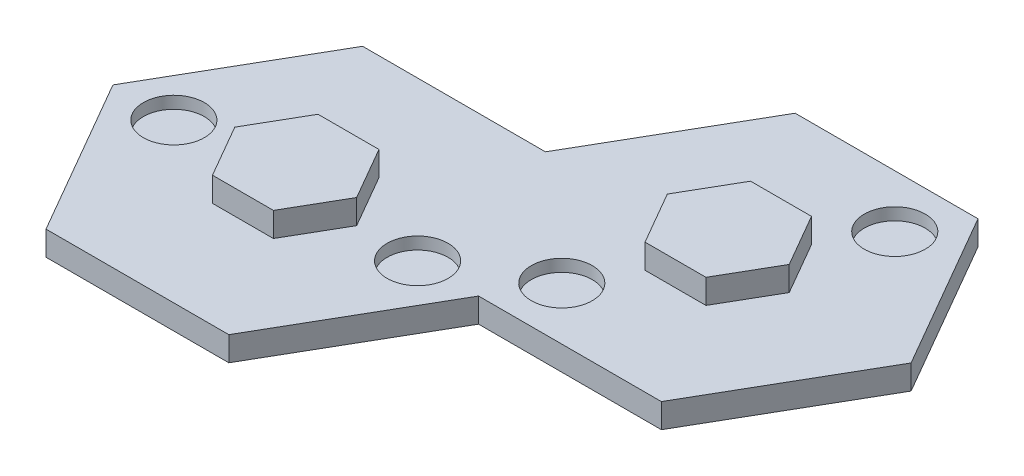
ISO-10303-21;
HEADER;
FILE_DESCRIPTION(('STEP AP214'),'2;1');
FILE_NAME('part.step','',(''),(''),'','','');
FILE_SCHEMA(('AUTOMOTIVE_DESIGN { 1 0 10303 214 1 1 1 1 }'));
ENDSEC;
DATA;
#1=APPLICATION_CONTEXT('core data for automotive mechanical design processes');
#2=APPLICATION_PROTOCOL_DEFINITION('international standard','automotive_design',2000,#1);
#3=PRODUCT_CONTEXT('',#1,'mechanical');
#4=PRODUCT('Part','Part','',(#3));
#5=PRODUCT_RELATED_PRODUCT_CATEGORY('part','',(#4));
#6=PRODUCT_DEFINITION_FORMATION('','',#4);
#7=PRODUCT_DEFINITION_CONTEXT('part definition',#1,'design');
#8=PRODUCT_DEFINITION('design','',#6,#7);
#9=PRODUCT_DEFINITION_SHAPE('','',#8);
#10=(LENGTH_UNIT() NAMED_UNIT(*) SI_UNIT(.MILLI.,.METRE.));
#11=(NAMED_UNIT(*) PLANE_ANGLE_UNIT() SI_UNIT($,.RADIAN.));
#12=(NAMED_UNIT(*) SI_UNIT($,.STERADIAN.) SOLID_ANGLE_UNIT());
#13=UNCERTAINTY_MEASURE_WITH_UNIT(LENGTH_MEASURE(1.E-05),#10,'distance_accuracy_value','');
#14=(GEOMETRIC_REPRESENTATION_CONTEXT(3) GLOBAL_UNCERTAINTY_ASSIGNED_CONTEXT((#13)) GLOBAL_UNIT_ASSIGNED_CONTEXT((#10,
#11,#12)) REPRESENTATION_CONTEXT('',''));
#15=CARTESIAN_POINT('',(0.,0.,0.));
#16=DIRECTION('',(0.,0.,1.));
#17=DIRECTION('',(1.,0.,0.));
#18=AXIS2_PLACEMENT_3D('',#15,#16,#17);
#19=CARTESIAN_POINT('',(0.,10.16,0.));
#20=DIRECTION('',(0.,1.,0.));
#21=DIRECTION('',(0.,0.,1.));
#22=AXIS2_PLACEMENT_3D('',#19,#20,#21);
#23=PLANE('',#22);
#24=DIRECTION('',(-0.5,0.,-0.866025403784439));
#25=VECTOR('',#24,1.);
#26=CARTESIAN_POINT('',(101.6,10.1599999999997,-43.9940905122495));
#27=LINE('',#26,#25);
#28=CARTESIAN_POINT('',(101.6,10.16,-43.9940905122496));
#29=VERTEX_POINT('',#28);
#30=CARTESIAN_POINT('',(88.9000000000001,10.1599999999997,-65.9911357683743));
#31=VERTEX_POINT('',#30);
#32=EDGE_CURVE('E187',#29,#31,#27,.T.);
#33=ORIENTED_EDGE('',*,*,#32,.T.);
#34=DIRECTION('',(0.5,0.,-0.866025403784439));
#35=VECTOR('',#34,1.);
#36=CARTESIAN_POINT('',(88.9000000000001,10.1599999999997,-65.9911357683743));
#37=LINE('',#36,#35);
#38=CARTESIAN_POINT('',(101.6,10.16,-87.9881810244991));
#39=VERTEX_POINT('',#38);
#40=EDGE_CURVE('E202',#31,#39,#37,.T.);
#41=ORIENTED_EDGE('',*,*,#40,.T.);
#42=DIRECTION('',(1.,0.,0.));
#43=VECTOR('',#42,1.);
#44=CARTESIAN_POINT('',(101.6,10.1599999999996,-87.988181024499));
#45=LINE('',#44,#43);
#46=CARTESIAN_POINT('',(127.,10.16,-87.988181024499));
#47=VERTEX_POINT('',#46);
#48=EDGE_CURVE('E222',#39,#47,#45,.T.);
#49=ORIENTED_EDGE('',*,*,#48,.T.);
#50=DIRECTION('',(0.5,0.,0.866025403784439));
#51=VECTOR('',#50,1.);
#52=CARTESIAN_POINT('',(127.,10.1599999999994,-87.988181024499));
#53=LINE('',#52,#51);
#54=CARTESIAN_POINT('',(139.7,10.16,-65.9911357683743));
#55=VERTEX_POINT('',#54);
#56=EDGE_CURVE('E220',#47,#55,#53,.T.);
#57=ORIENTED_EDGE('',*,*,#56,.T.);
#58=DIRECTION('',(-0.5,0.,0.866025403784439));
#59=VECTOR('',#58,1.);
#60=CARTESIAN_POINT('',(139.7,10.1599999999994,-65.9911357683743));
#61=LINE('',#60,#59);
#62=CARTESIAN_POINT('',(127.,10.16,-43.9940905122496));
#63=VERTEX_POINT('',#62);
#64=EDGE_CURVE('E53',#55,#63,#61,.T.);
#65=ORIENTED_EDGE('',*,*,#64,.T.);
#66=DIRECTION('',(-1.,0.,0.));
#67=VECTOR('',#66,1.);
#68=CARTESIAN_POINT('',(127.,10.1599999999996,-43.9940905122496));
#69=LINE('',#68,#67);
#70=EDGE_CURVE('E48',#63,#29,#69,.T.);
#71=ORIENTED_EDGE('',*,*,#70,.T.);
#72=EDGE_LOOP('',(#33,#41,#49,#57,#65,#71));
#73=FACE_BOUND('',#72,.T.);
#74=CARTESIAN_POINT('',(88.9,10.16,-21.9970452561247));
#75=DIRECTION('',(0.,-1.,0.));
#76=DIRECTION('',(-0.866025403784439,0.,-0.5));
#77=AXIS2_PLACEMENT_3D('',#74,#75,#76);
#78=CIRCLE('',#77,12.7);
#79=CARTESIAN_POINT('',(77.9014773719376,10.16,-28.3470452561247));
#80=VERTEX_POINT('',#79);
#81=EDGE_CURVE('E283',#80,#80,#78,.T.);
#82=ORIENTED_EDGE('',*,*,#81,.T.);
#83=EDGE_LOOP('',(#82));
#84=FACE_BOUND('',#83,.T.);
#85=CARTESIAN_POINT('',(139.7,10.16,-109.985226280624));
#86=DIRECTION('',(0.,-1.,0.));
#87=DIRECTION('',(0.866025403784439,0.,0.5));
#88=AXIS2_PLACEMENT_3D('',#85,#86,#87);
#89=CIRCLE('',#88,12.7);
#90=CARTESIAN_POINT('',(150.698522628062,10.16,-103.635226280624));
#91=VERTEX_POINT('',#90);
#92=EDGE_CURVE('E278',#91,#91,#89,.T.);
#93=ORIENTED_EDGE('',*,*,#92,.T.);
#94=EDGE_LOOP('',(#93));
#95=FACE_BOUND('',#94,.T.);
#96=CARTESIAN_POINT('',(50.8,10.16,0.));
#97=DIRECTION('',(0.,1.,0.));
#98=DIRECTION('',(0.,0.,-1.));
#99=AXIS2_PLACEMENT_3D('',#96,#97,#98);
#100=CIRCLE('',#99,12.7);
#101=CARTESIAN_POINT('',(50.8,10.16,-12.7));
#102=VERTEX_POINT('',#101);
#103=EDGE_CURVE('E333',#102,#102,#100,.T.);
#104=ORIENTED_EDGE('',*,*,#103,.F.);
#105=EDGE_LOOP('',(#104));
#106=FACE_BOUND('',#105,.T.);
#107=CARTESIAN_POINT('',(-50.8,10.16,0.));
#108=DIRECTION('',(0.,1.,0.));
#109=DIRECTION('',(0.,0.,1.));
#110=AXIS2_PLACEMENT_3D('',#107,#108,#109);
#111=CIRCLE('',#110,12.7);
#112=CARTESIAN_POINT('',(-50.8,10.16,12.7));
#113=VERTEX_POINT('',#112);
#114=EDGE_CURVE('E328',#113,#113,#111,.T.);
#115=ORIENTED_EDGE('',*,*,#114,.F.);
#116=EDGE_LOOP('',(#115));
#117=FACE_BOUND('',#116,.T.);
#118=DIRECTION('',(0.5,0.,-0.866025403784438));
#119=VECTOR('',#118,1.);
#120=CARTESIAN_POINT('',(38.1,10.16,65.9911357683742));
#121=LINE('',#120,#119);
#122=CARTESIAN_POINT('',(38.1,10.16,65.9911357683742));
#123=VERTEX_POINT('',#122);
#124=CARTESIAN_POINT('',(76.2,10.16,0.));
#125=VERTEX_POINT('',#124);
#126=EDGE_CURVE('E350',#123,#125,#121,.T.);
#127=ORIENTED_EDGE('',*,*,#126,.T.);
#128=DIRECTION('',(-1.,0.,0.));
#129=VECTOR('',#128,1.);
#130=CARTESIAN_POINT('',(152.4,10.16,0.));
#131=LINE('',#130,#129);
#132=CARTESIAN_POINT('',(152.4,10.16,0.));
#133=VERTEX_POINT('',#132);
#134=EDGE_CURVE('E291',#133,#125,#131,.T.);
#135=ORIENTED_EDGE('',*,*,#134,.F.);
#136=DIRECTION('',(-0.5,0.,0.866025403784439));
#137=VECTOR('',#136,1.);
#138=CARTESIAN_POINT('',(190.5,10.16,-65.9911357683742));
#139=LINE('',#138,#137);
#140=CARTESIAN_POINT('',(190.5,10.16,-65.9911357683742));
#141=VERTEX_POINT('',#140);
#142=EDGE_CURVE('E294',#141,#133,#139,.T.);
#143=ORIENTED_EDGE('',*,*,#142,.F.);
#144=DIRECTION('',(0.5,0.,0.866025403784439));
#145=VECTOR('',#144,1.);
#146=CARTESIAN_POINT('',(152.4,10.16,-131.982271536748));
#147=LINE('',#146,#145);
#148=CARTESIAN_POINT('',(152.4,10.16,-131.982271536748));
#149=VERTEX_POINT('',#148);
#150=EDGE_CURVE('E298',#149,#141,#147,.T.);
#151=ORIENTED_EDGE('',*,*,#150,.F.);
#152=DIRECTION('',(1.,0.,0.));
#153=VECTOR('',#152,1.);
#154=CARTESIAN_POINT('',(76.2,10.16,-131.982271536748));
#155=LINE('',#154,#153);
#156=CARTESIAN_POINT('',(76.2,10.16,-131.982271536748));
#157=VERTEX_POINT('',#156);
#158=EDGE_CURVE('E301',#157,#149,#155,.T.);
#159=ORIENTED_EDGE('',*,*,#158,.F.);
#160=DIRECTION('',(0.5,0.,-0.866025403784439));
#161=VECTOR('',#160,1.);
#162=CARTESIAN_POINT('',(38.1,10.16,-65.9911357683742));
#163=LINE('',#162,#161);
#164=CARTESIAN_POINT('',(38.1,10.16,-65.9911357683742));
#165=VERTEX_POINT('',#164);
#166=EDGE_CURVE('E304',#165,#157,#163,.T.);
#167=ORIENTED_EDGE('',*,*,#166,.F.);
#168=DIRECTION('',(-1.,0.,0.));
#169=VECTOR('',#168,1.);
#170=CARTESIAN_POINT('',(38.1,10.16,-65.9911357683742));
#171=LINE('',#170,#169);
#172=CARTESIAN_POINT('',(-38.1,10.16,-65.9911357683742));
#173=VERTEX_POINT('',#172);
#174=EDGE_CURVE('E341',#165,#173,#171,.T.);
#175=ORIENTED_EDGE('',*,*,#174,.T.);
#176=DIRECTION('',(-0.5,0.,0.866025403784439));
#177=VECTOR('',#176,1.);
#178=CARTESIAN_POINT('',(-38.1,10.16,-65.9911357683742));
#179=LINE('',#178,#177);
#180=CARTESIAN_POINT('',(-76.2,10.16,0.));
#181=VERTEX_POINT('',#180);
#182=EDGE_CURVE('E343',#173,#181,#179,.T.);
#183=ORIENTED_EDGE('',*,*,#182,.T.);
#184=DIRECTION('',(0.5,0.,0.866025403784439));
#185=VECTOR('',#184,1.);
#186=CARTESIAN_POINT('',(-76.2,10.16,0.));
#187=LINE('',#186,#185);
#188=CARTESIAN_POINT('',(-38.1,10.16,65.9911357683742));
#189=VERTEX_POINT('',#188);
#190=EDGE_CURVE('E346',#181,#189,#187,.T.);
#191=ORIENTED_EDGE('',*,*,#190,.T.);
#192=DIRECTION('',(1.,0.,0.));
#193=VECTOR('',#192,1.);
#194=CARTESIAN_POINT('',(-38.1,10.16,65.9911357683742));
#195=LINE('',#194,#193);
#196=EDGE_CURVE('E348',#189,#123,#195,.T.);
#197=ORIENTED_EDGE('',*,*,#196,.T.);
#198=EDGE_LOOP('',(#127,#135,#143,#151,#159,#167,#175,#183,#191,#197));
#199=FACE_BOUND('',#198,.T.);
#200=DIRECTION('',(-1.,0.,0.));
#201=VECTOR('',#200,1.);
#202=CARTESIAN_POINT('',(12.7,10.16,-21.9970452561247));
#203=LINE('',#202,#201);
#204=CARTESIAN_POINT('',(12.7,10.16,-21.9970452561247));
#205=VERTEX_POINT('',#204);
#206=CARTESIAN_POINT('',(-12.7,10.16,-21.9970452561247));
#207=VERTEX_POINT('',#206);
#208=EDGE_CURVE('E253',#205,#207,#203,.T.);
#209=ORIENTED_EDGE('',*,*,#208,.F.);
#210=DIRECTION('',(-0.5,0.,-0.866025403784438));
#211=VECTOR('',#210,1.);
#212=CARTESIAN_POINT('',(25.4,10.16,0.));
#213=LINE('',#212,#211);
#214=CARTESIAN_POINT('',(25.4,10.16,0.));
#215=VERTEX_POINT('',#214);
#216=EDGE_CURVE('E190',#215,#205,#213,.T.);
#217=ORIENTED_EDGE('',*,*,#216,.F.);
#218=DIRECTION('',(0.5,0.,-0.866025403784438));
#219=VECTOR('',#218,1.);
#220=CARTESIAN_POINT('',(12.7,10.16,21.9970452561247));
#221=LINE('',#220,#219);
#222=CARTESIAN_POINT('',(12.7,10.16,21.9970452561247));
#223=VERTEX_POINT('',#222);
#224=EDGE_CURVE('E240',#223,#215,#221,.T.);
#225=ORIENTED_EDGE('',*,*,#224,.F.);
#226=DIRECTION('',(1.,0.,0.));
#227=VECTOR('',#226,1.);
#228=CARTESIAN_POINT('',(-12.7,10.16,21.9970452561247));
#229=LINE('',#228,#227);
#230=CARTESIAN_POINT('',(-12.7,10.16,21.9970452561247));
#231=VERTEX_POINT('',#230);
#232=EDGE_CURVE('E259',#231,#223,#229,.T.);
#233=ORIENTED_EDGE('',*,*,#232,.F.);
#234=DIRECTION('',(0.5,0.,0.866025403784439));
#235=VECTOR('',#234,1.);
#236=CARTESIAN_POINT('',(-25.4,10.16,0.));
#237=LINE('',#236,#235);
#238=CARTESIAN_POINT('',(-25.4,10.16,0.));
#239=VERTEX_POINT('',#238);
#240=EDGE_CURVE('E257',#239,#231,#237,.T.);
#241=ORIENTED_EDGE('',*,*,#240,.F.);
#242=DIRECTION('',(-0.5,0.,0.866025403784439));
#243=VECTOR('',#242,1.);
#244=CARTESIAN_POINT('',(-12.7,10.16,-21.9970452561247));
#245=LINE('',#244,#243);
#246=EDGE_CURVE('E255',#207,#239,#245,.T.);
#247=ORIENTED_EDGE('',*,*,#246,.F.);
#248=EDGE_LOOP('',(#209,#217,#225,#233,#241,#247));
#249=FACE_BOUND('',#248,.T.);
#250=ADVANCED_FACE('F33',(#73,#84,#95,#106,#117,#199,#249),#23,.T.);
#251=CARTESIAN_POINT('',(38.1,10.16,-65.9911357683742));
#252=DIRECTION('',(0.,0.,1.));
#253=DIRECTION('',(1.,0.,0.));
#254=AXIS2_PLACEMENT_3D('',#251,#252,#253);
#255=PLANE('',#254);
#256=DIRECTION('',(-1.,0.,0.));
#257=VECTOR('',#256,1.);
#258=CARTESIAN_POINT('',(38.1,0.,-65.9911357683742));
#259=LINE('',#258,#257);
#260=CARTESIAN_POINT('',(38.1,0.,-65.9911357683742));
#261=VERTEX_POINT('',#260);
#262=CARTESIAN_POINT('',(-38.1,0.,-65.9911357683742));
#263=VERTEX_POINT('',#262);
#264=EDGE_CURVE('E332',#261,#263,#259,.T.);
#265=ORIENTED_EDGE('',*,*,#264,.T.);
#266=DIRECTION('',(0.,-1.,0.));
#267=VECTOR('',#266,1.);
#268=CARTESIAN_POINT('',(-38.1,10.16,-65.9911357683742));
#269=LINE('',#268,#267);
#270=EDGE_CURVE('E41',#173,#263,#269,.T.);
#271=ORIENTED_EDGE('',*,*,#270,.F.);
#272=ORIENTED_EDGE('',*,*,#174,.F.);
#273=DIRECTION('',(0.,-1.,0.));
#274=VECTOR('',#273,1.);
#275=CARTESIAN_POINT('',(38.1,10.16,-65.9911357683742));
#276=LINE('',#275,#274);
#277=EDGE_CURVE('E11',#165,#261,#276,.T.);
#278=ORIENTED_EDGE('',*,*,#277,.T.);
#279=EDGE_LOOP('',(#265,#271,#272,#278));
#280=FACE_BOUND('',#279,.T.);
#281=ADVANCED_FACE('F35',(#280),#255,.F.);
#282=CARTESIAN_POINT('',(-38.1,10.16,-65.9911357683742));
#283=DIRECTION('',(0.866025403784439,0.,0.5));
#284=DIRECTION('',(0.5,0.,-0.866025403784439));
#285=AXIS2_PLACEMENT_3D('',#282,#283,#284);
#286=PLANE('',#285);
#287=DIRECTION('',(-0.5,0.,0.866025403784439));
#288=VECTOR('',#287,1.);
#289=CARTESIAN_POINT('',(-38.1,0.,-65.9911357683742));
#290=LINE('',#289,#288);
#291=CARTESIAN_POINT('',(-76.2,0.,0.));
#292=VERTEX_POINT('',#291);
#293=EDGE_CURVE('E354',#263,#292,#290,.T.);
#294=ORIENTED_EDGE('',*,*,#293,.T.);
#295=DIRECTION('',(0.,-1.,0.));
#296=VECTOR('',#295,1.);
#297=CARTESIAN_POINT('',(-76.2,10.16,0.));
#298=LINE('',#297,#296);
#299=EDGE_CURVE('E369',#181,#292,#298,.T.);
#300=ORIENTED_EDGE('',*,*,#299,.F.);
#301=ORIENTED_EDGE('',*,*,#182,.F.);
#302=ORIENTED_EDGE('',*,*,#270,.T.);
#303=EDGE_LOOP('',(#294,#300,#301,#302));
#304=FACE_BOUND('',#303,.T.);
#305=ADVANCED_FACE('F376',(#304),#286,.F.);
#306=CARTESIAN_POINT('',(-76.2,10.16,0.));
#307=DIRECTION('',(0.866025403784439,0.,-0.5));
#308=DIRECTION('',(-0.5,0.,-0.866025403784439));
#309=AXIS2_PLACEMENT_3D('',#306,#307,#308);
#310=PLANE('',#309);
#311=DIRECTION('',(0.5,0.,0.866025403784439));
#312=VECTOR('',#311,1.);
#313=CARTESIAN_POINT('',(-76.2,0.,0.));
#314=LINE('',#313,#312);
#315=CARTESIAN_POINT('',(-38.1,0.,65.9911357683742));
#316=VERTEX_POINT('',#315);
#317=EDGE_CURVE('E356',#292,#316,#314,.T.);
#318=ORIENTED_EDGE('',*,*,#317,.T.);
#319=DIRECTION('',(0.,-1.,0.));
#320=VECTOR('',#319,1.);
#321=CARTESIAN_POINT('',(-38.1,10.16,65.9911357683742));
#322=LINE('',#321,#320);
#323=EDGE_CURVE('E366',#189,#316,#322,.T.);
#324=ORIENTED_EDGE('',*,*,#323,.F.);
#325=ORIENTED_EDGE('',*,*,#190,.F.);
#326=ORIENTED_EDGE('',*,*,#299,.T.);
#327=EDGE_LOOP('',(#318,#324,#325,#326));
#328=FACE_BOUND('',#327,.T.);
#329=ADVANCED_FACE('F386',(#328),#310,.F.);
#330=CARTESIAN_POINT('',(-38.1,10.16,65.9911357683742));
#331=DIRECTION('',(0.,0.,-1.));
#332=DIRECTION('',(-1.,0.,0.));
#333=AXIS2_PLACEMENT_3D('',#330,#331,#332);
#334=PLANE('',#333);
#335=DIRECTION('',(1.,0.,0.));
#336=VECTOR('',#335,1.);
#337=CARTESIAN_POINT('',(-38.1,0.,65.9911357683742));
#338=LINE('',#337,#336);
#339=CARTESIAN_POINT('',(38.1,0.,65.9911357683742));
#340=VERTEX_POINT('',#339);
#341=EDGE_CURVE('E358',#316,#340,#338,.T.);
#342=ORIENTED_EDGE('',*,*,#341,.T.);
#343=DIRECTION('',(0.,-1.,0.));
#344=VECTOR('',#343,1.);
#345=CARTESIAN_POINT('',(38.1,10.16,65.9911357683742));
#346=LINE('',#345,#344);
#347=EDGE_CURVE('E363',#123,#340,#346,.T.);
#348=ORIENTED_EDGE('',*,*,#347,.F.);
#349=ORIENTED_EDGE('',*,*,#196,.F.);
#350=ORIENTED_EDGE('',*,*,#323,.T.);
#351=EDGE_LOOP('',(#342,#348,#349,#350));
#352=FACE_BOUND('',#351,.T.);
#353=ADVANCED_FACE('F390',(#352),#334,.F.);
#354=CARTESIAN_POINT('',(38.1,10.16,65.9911357683742));
#355=DIRECTION('',(-0.866025403784438,0.,-0.5));
#356=DIRECTION('',(-0.5,0.,0.866025403784439));
#357=AXIS2_PLACEMENT_3D('',#354,#355,#356);
#358=PLANE('',#357);
#359=DIRECTION('',(0.5,0.,-0.866025403784438));
#360=VECTOR('',#359,1.);
#361=CARTESIAN_POINT('',(38.1,0.,65.9911357683742));
#362=LINE('',#361,#360);
#363=CARTESIAN_POINT('',(76.2,0.,0.));
#364=VERTEX_POINT('',#363);
#365=EDGE_CURVE('E344',#340,#364,#362,.T.);
#366=ORIENTED_EDGE('',*,*,#365,.T.);
#367=DIRECTION('',(0.,-1.,0.));
#368=VECTOR('',#367,1.);
#369=CARTESIAN_POINT('',(76.2,10.16,0.));
#370=LINE('',#369,#368);
#371=EDGE_CURVE('E352',#125,#364,#370,.T.);
#372=ORIENTED_EDGE('',*,*,#371,.F.);
#373=ORIENTED_EDGE('',*,*,#126,.F.);
#374=ORIENTED_EDGE('',*,*,#347,.T.);
#375=EDGE_LOOP('',(#366,#372,#373,#374));
#376=FACE_BOUND('',#375,.T.);
#377=ADVANCED_FACE('F418',(#376),#358,.F.);
#378=CARTESIAN_POINT('',(0.,0.,0.));
#379=DIRECTION('',(0.,1.,0.));
#380=DIRECTION('',(0.,0.,1.));
#381=AXIS2_PLACEMENT_3D('',#378,#379,#380);
#382=PLANE('',#381);
#383=ORIENTED_EDGE('',*,*,#264,.F.);
#384=DIRECTION('',(0.5,0.,-0.866025403784439));
#385=VECTOR('',#384,1.);
#386=CARTESIAN_POINT('',(38.1,0.,-65.9911357683742));
#387=LINE('',#386,#385);
#388=CARTESIAN_POINT('',(76.2,0.,-131.982271536748));
#389=VERTEX_POINT('',#388);
#390=EDGE_CURVE('E295',#261,#389,#387,.T.);
#391=ORIENTED_EDGE('',*,*,#390,.T.);
#392=DIRECTION('',(1.,0.,0.));
#393=VECTOR('',#392,1.);
#394=CARTESIAN_POINT('',(76.2,0.,-131.982271536748));
#395=LINE('',#394,#393);
#396=CARTESIAN_POINT('',(152.4,0.,-131.982271536748));
#397=VERTEX_POINT('',#396);
#398=EDGE_CURVE('E316',#389,#397,#395,.T.);
#399=ORIENTED_EDGE('',*,*,#398,.T.);
#400=DIRECTION('',(0.5,0.,0.866025403784439));
#401=VECTOR('',#400,1.);
#402=CARTESIAN_POINT('',(152.4,0.,-131.982271536748));
#403=LINE('',#402,#401);
#404=CARTESIAN_POINT('',(190.5,0.,-65.9911357683742));
#405=VERTEX_POINT('',#404);
#406=EDGE_CURVE('E313',#397,#405,#403,.T.);
#407=ORIENTED_EDGE('',*,*,#406,.T.);
#408=DIRECTION('',(-0.5,0.,0.866025403784439));
#409=VECTOR('',#408,1.);
#410=CARTESIAN_POINT('',(190.5,0.,-65.9911357683742));
#411=LINE('',#410,#409);
#412=CARTESIAN_POINT('',(152.4,0.,0.));
#413=VERTEX_POINT('',#412);
#414=EDGE_CURVE('E310',#405,#413,#411,.T.);
#415=ORIENTED_EDGE('',*,*,#414,.T.);
#416=DIRECTION('',(-1.,0.,0.));
#417=VECTOR('',#416,1.);
#418=CARTESIAN_POINT('',(152.4,0.,0.));
#419=LINE('',#418,#417);
#420=EDGE_CURVE('E282',#413,#364,#419,.T.);
#421=ORIENTED_EDGE('',*,*,#420,.T.);
#422=ORIENTED_EDGE('',*,*,#365,.F.);
#423=ORIENTED_EDGE('',*,*,#341,.F.);
#424=ORIENTED_EDGE('',*,*,#317,.F.);
#425=ORIENTED_EDGE('',*,*,#293,.F.);
#426=EDGE_LOOP('',(#383,#391,#399,#407,#415,#421,#422,#423,#424,#425));
#427=FACE_BOUND('',#426,.T.);
#428=ADVANCED_FACE('F381',(#427),#382,.F.);
#429=CARTESIAN_POINT('',(-50.8,5.08,0.));
#430=DIRECTION('',(0.,1.,0.));
#431=DIRECTION('',(0.,0.,1.));
#432=AXIS2_PLACEMENT_3D('',#429,#430,#431);
#433=CYLINDRICAL_SURFACE('',#432,12.7);
#434=CARTESIAN_POINT('',(-50.8,5.08,0.));
#435=DIRECTION('',(0.,1.,0.));
#436=DIRECTION('',(0.,0.,1.));
#437=AXIS2_PLACEMENT_3D('',#434,#435,#436);
#438=CIRCLE('',#437,12.7);
#439=CARTESIAN_POINT('',(-50.8,5.08,12.7));
#440=VERTEX_POINT('',#439);
#441=EDGE_CURVE('E336',#440,#440,#438,.T.);
#442=ORIENTED_EDGE('',*,*,#441,.F.);
#443=EDGE_LOOP('',(#442));
#444=FACE_BOUND('',#443,.T.);
#445=ORIENTED_EDGE('',*,*,#114,.T.);
#446=EDGE_LOOP('',(#445));
#447=FACE_BOUND('',#446,.T.);
#448=ADVANCED_FACE('F425',(#444,#447),#433,.F.);
#449=CARTESIAN_POINT('',(-50.8,5.08,0.));
#450=DIRECTION('',(0.,1.,0.));
#451=DIRECTION('',(0.,0.,1.));
#452=AXIS2_PLACEMENT_3D('',#449,#450,#451);
#453=PLANE('',#452);
#454=ORIENTED_EDGE('',*,*,#441,.T.);
#455=EDGE_LOOP('',(#454));
#456=FACE_BOUND('',#455,.T.);
#457=ADVANCED_FACE('F437',(#456),#453,.T.);
#458=CARTESIAN_POINT('',(50.8,5.08,0.));
#459=DIRECTION('',(0.,1.,0.));
#460=DIRECTION('',(0.,0.,1.));
#461=AXIS2_PLACEMENT_3D('',#458,#459,#460);
#462=CYLINDRICAL_SURFACE('',#461,12.7);
#463=CARTESIAN_POINT('',(50.8,5.08,0.));
#464=DIRECTION('',(0.,1.,0.));
#465=DIRECTION('',(0.,0.,-1.));
#466=AXIS2_PLACEMENT_3D('',#463,#464,#465);
#467=CIRCLE('',#466,12.7);
#468=CARTESIAN_POINT('',(50.8,5.08,-12.7));
#469=VERTEX_POINT('',#468);
#470=EDGE_CURVE('E329',#469,#469,#467,.T.);
#471=ORIENTED_EDGE('',*,*,#470,.F.);
#472=EDGE_LOOP('',(#471));
#473=FACE_BOUND('',#472,.T.);
#474=ORIENTED_EDGE('',*,*,#103,.T.);
#475=EDGE_LOOP('',(#474));
#476=FACE_BOUND('',#475,.T.);
#477=ADVANCED_FACE('F441',(#473,#476),#462,.F.);
#478=CARTESIAN_POINT('',(50.8,5.08,0.));
#479=DIRECTION('',(0.,-1.,0.));
#480=DIRECTION('',(0.,0.,-1.));
#481=AXIS2_PLACEMENT_3D('',#478,#479,#480);
#482=PLANE('',#481);
#483=ORIENTED_EDGE('',*,*,#470,.T.);
#484=EDGE_LOOP('',(#483));
#485=FACE_BOUND('',#484,.T.);
#486=ADVANCED_FACE('F445',(#485),#482,.F.);
#487=CARTESIAN_POINT('',(152.4,10.16,0.));
#488=DIRECTION('',(0.,0.,1.));
#489=DIRECTION('',(1.,0.,0.));
#490=AXIS2_PLACEMENT_3D('',#487,#488,#489);
#491=PLANE('',#490);
#492=ORIENTED_EDGE('',*,*,#420,.F.);
#493=DIRECTION('',(0.,-1.,0.));
#494=VECTOR('',#493,1.);
#495=CARTESIAN_POINT('',(152.4,10.16,0.));
#496=LINE('',#495,#494);
#497=EDGE_CURVE('E326',#133,#413,#496,.T.);
#498=ORIENTED_EDGE('',*,*,#497,.F.);
#499=ORIENTED_EDGE('',*,*,#134,.T.);
#500=ORIENTED_EDGE('',*,*,#371,.T.);
#501=EDGE_LOOP('',(#492,#498,#499,#500));
#502=FACE_BOUND('',#501,.T.);
#503=ADVANCED_FACE('F416',(#502),#491,.T.);
#504=CARTESIAN_POINT('',(190.5,10.16,-65.9911357683742));
#505=DIRECTION('',(0.866025403784439,0.,0.5));
#506=DIRECTION('',(0.5,0.,-0.866025403784439));
#507=AXIS2_PLACEMENT_3D('',#504,#505,#506);
#508=PLANE('',#507);
#509=ORIENTED_EDGE('',*,*,#414,.F.);
#510=DIRECTION('',(0.,-1.,0.));
#511=VECTOR('',#510,1.);
#512=CARTESIAN_POINT('',(190.5,10.16,-65.9911357683742));
#513=LINE('',#512,#511);
#514=EDGE_CURVE('E324',#141,#405,#513,.T.);
#515=ORIENTED_EDGE('',*,*,#514,.F.);
#516=ORIENTED_EDGE('',*,*,#142,.T.);
#517=ORIENTED_EDGE('',*,*,#497,.T.);
#518=EDGE_LOOP('',(#509,#515,#516,#517));
#519=FACE_BOUND('',#518,.T.);
#520=ADVANCED_FACE('F413',(#519),#508,.T.);
#521=CARTESIAN_POINT('',(152.4,10.16,-131.982271536748));
#522=DIRECTION('',(0.866025403784439,0.,-0.5));
#523=DIRECTION('',(-0.5,0.,-0.866025403784439));
#524=AXIS2_PLACEMENT_3D('',#521,#522,#523);
#525=PLANE('',#524);
#526=ORIENTED_EDGE('',*,*,#406,.F.);
#527=DIRECTION('',(0.,-1.,0.));
#528=VECTOR('',#527,1.);
#529=CARTESIAN_POINT('',(152.4,10.16,-131.982271536748));
#530=LINE('',#529,#528);
#531=EDGE_CURVE('E322',#149,#397,#530,.T.);
#532=ORIENTED_EDGE('',*,*,#531,.F.);
#533=ORIENTED_EDGE('',*,*,#150,.T.);
#534=ORIENTED_EDGE('',*,*,#514,.T.);
#535=EDGE_LOOP('',(#526,#532,#533,#534));
#536=FACE_BOUND('',#535,.T.);
#537=ADVANCED_FACE('F409',(#536),#525,.T.);
#538=CARTESIAN_POINT('',(76.2,10.16,-131.982271536748));
#539=DIRECTION('',(0.,0.,-1.));
#540=DIRECTION('',(-1.,0.,0.));
#541=AXIS2_PLACEMENT_3D('',#538,#539,#540);
#542=PLANE('',#541);
#543=ORIENTED_EDGE('',*,*,#398,.F.);
#544=DIRECTION('',(0.,-1.,0.));
#545=VECTOR('',#544,1.);
#546=CARTESIAN_POINT('',(76.2,10.16,-131.982271536748));
#547=LINE('',#546,#545);
#548=EDGE_CURVE('E307',#157,#389,#547,.T.);
#549=ORIENTED_EDGE('',*,*,#548,.F.);
#550=ORIENTED_EDGE('',*,*,#158,.T.);
#551=ORIENTED_EDGE('',*,*,#531,.T.);
#552=EDGE_LOOP('',(#543,#549,#550,#551));
#553=FACE_BOUND('',#552,.T.);
#554=ADVANCED_FACE('F406',(#553),#542,.T.);
#555=CARTESIAN_POINT('',(38.1,10.16,-65.9911357683742));
#556=DIRECTION('',(-0.866025403784439,0.,-0.5));
#557=DIRECTION('',(-0.5,0.,0.866025403784439));
#558=AXIS2_PLACEMENT_3D('',#555,#556,#557);
#559=PLANE('',#558);
#560=ORIENTED_EDGE('',*,*,#390,.F.);
#561=ORIENTED_EDGE('',*,*,#277,.F.);
#562=ORIENTED_EDGE('',*,*,#166,.T.);
#563=ORIENTED_EDGE('',*,*,#548,.T.);
#564=EDGE_LOOP('',(#560,#561,#562,#563));
#565=FACE_BOUND('',#564,.T.);
#566=ADVANCED_FACE('F402',(#565),#559,.T.);
#567=CARTESIAN_POINT('',(139.7,5.08,-109.985226280624));
#568=DIRECTION('',(0.,1.,0.));
#569=DIRECTION('',(0.,0.,1.));
#570=AXIS2_PLACEMENT_3D('',#567,#568,#569);
#571=CYLINDRICAL_SURFACE('',#570,12.7);
#572=CARTESIAN_POINT('',(139.7,5.08,-109.985226280624));
#573=DIRECTION('',(0.,-1.,0.));
#574=DIRECTION('',(0.866025403784439,0.,0.5));
#575=AXIS2_PLACEMENT_3D('',#572,#573,#574);
#576=CIRCLE('',#575,12.7);
#577=CARTESIAN_POINT('',(150.698522628062,5.08,-103.635226280624));
#578=VERTEX_POINT('',#577);
#579=EDGE_CURVE('E286',#578,#578,#576,.T.);
#580=ORIENTED_EDGE('',*,*,#579,.T.);
#581=EDGE_LOOP('',(#580));
#582=FACE_BOUND('',#581,.T.);
#583=ORIENTED_EDGE('',*,*,#92,.F.);
#584=EDGE_LOOP('',(#583));
#585=FACE_BOUND('',#584,.T.);
#586=ADVANCED_FACE('F460',(#582,#585),#571,.F.);
#587=CARTESIAN_POINT('',(139.7,5.08,-109.985226280624));
#588=DIRECTION('',(0.,1.,0.));
#589=DIRECTION('',(0.866025403784439,0.,0.5));
#590=AXIS2_PLACEMENT_3D('',#587,#588,#589);
#591=PLANE('',#590);
#592=ORIENTED_EDGE('',*,*,#579,.F.);
#593=EDGE_LOOP('',(#592));
#594=FACE_BOUND('',#593,.T.);
#595=ADVANCED_FACE('F463',(#594),#591,.T.);
#596=CARTESIAN_POINT('',(88.9,5.08,-21.9970452561247));
#597=DIRECTION('',(0.,1.,0.));
#598=DIRECTION('',(0.,0.,1.));
#599=AXIS2_PLACEMENT_3D('',#596,#597,#598);
#600=CYLINDRICAL_SURFACE('',#599,12.7);
#601=CARTESIAN_POINT('',(88.9,5.08,-21.9970452561247));
#602=DIRECTION('',(0.,-1.,0.));
#603=DIRECTION('',(-0.866025403784439,0.,-0.5));
#604=AXIS2_PLACEMENT_3D('',#601,#602,#603);
#605=CIRCLE('',#604,12.7);
#606=CARTESIAN_POINT('',(77.9014773719376,5.08,-28.3470452561247));
#607=VERTEX_POINT('',#606);
#608=EDGE_CURVE('E279',#607,#607,#605,.T.);
#609=ORIENTED_EDGE('',*,*,#608,.T.);
#610=EDGE_LOOP('',(#609));
#611=FACE_BOUND('',#610,.T.);
#612=ORIENTED_EDGE('',*,*,#81,.F.);
#613=EDGE_LOOP('',(#612));
#614=FACE_BOUND('',#613,.T.);
#615=ADVANCED_FACE('F467',(#611,#614),#600,.F.);
#616=CARTESIAN_POINT('',(88.9,5.08,-21.9970452561247));
#617=DIRECTION('',(0.,-1.,0.));
#618=DIRECTION('',(-0.866025403784439,0.,-0.5));
#619=AXIS2_PLACEMENT_3D('',#616,#617,#618);
#620=PLANE('',#619);
#621=ORIENTED_EDGE('',*,*,#608,.F.);
#622=EDGE_LOOP('',(#621));
#623=FACE_BOUND('',#622,.T.);
#624=ADVANCED_FACE('F471',(#623),#620,.F.);
#625=CARTESIAN_POINT('',(25.4,20.32,0.));
#626=DIRECTION('',(-0.866025403784438,0.,0.5));
#627=DIRECTION('',(0.5,0.,0.866025403784438));
#628=AXIS2_PLACEMENT_3D('',#625,#626,#627);
#629=PLANE('',#628);
#630=ORIENTED_EDGE('',*,*,#216,.T.);
#631=DIRECTION('',(0.,-1.,0.));
#632=VECTOR('',#631,1.);
#633=CARTESIAN_POINT('',(12.7,20.32,-21.9970452561247));
#634=LINE('',#633,#632);
#635=CARTESIAN_POINT('',(12.7,20.32,-21.9970452561247));
#636=VERTEX_POINT('',#635);
#637=EDGE_CURVE('E276',#636,#205,#634,.T.);
#638=ORIENTED_EDGE('',*,*,#637,.F.);
#639=DIRECTION('',(-0.5,0.,-0.866025403784438));
#640=VECTOR('',#639,1.);
#641=CARTESIAN_POINT('',(25.4,20.32,0.));
#642=LINE('',#641,#640);
#643=CARTESIAN_POINT('',(25.4,20.32,0.));
#644=VERTEX_POINT('',#643);
#645=EDGE_CURVE('E236',#644,#636,#642,.T.);
#646=ORIENTED_EDGE('',*,*,#645,.F.);
#647=DIRECTION('',(0.,-1.,0.));
#648=VECTOR('',#647,1.);
#649=CARTESIAN_POINT('',(25.4,20.32,0.));
#650=LINE('',#649,#648);
#651=EDGE_CURVE('E250',#644,#215,#650,.T.);
#652=ORIENTED_EDGE('',*,*,#651,.T.);
#653=EDGE_LOOP('',(#630,#638,#646,#652));
#654=FACE_BOUND('',#653,.T.);
#655=ADVANCED_FACE('F475',(#654),#629,.F.);
#656=CARTESIAN_POINT('',(12.7,20.32,-21.9970452561247));
#657=DIRECTION('',(0.,0.,1.));
#658=DIRECTION('',(1.,0.,0.));
#659=AXIS2_PLACEMENT_3D('',#656,#657,#658);
#660=PLANE('',#659);
#661=ORIENTED_EDGE('',*,*,#208,.T.);
#662=DIRECTION('',(0.,-1.,0.));
#663=VECTOR('',#662,1.);
#664=CARTESIAN_POINT('',(-12.7,20.32,-21.9970452561247));
#665=LINE('',#664,#663);
#666=CARTESIAN_POINT('',(-12.7,20.32,-21.9970452561247));
#667=VERTEX_POINT('',#666);
#668=EDGE_CURVE('E273',#667,#207,#665,.T.);
#669=ORIENTED_EDGE('',*,*,#668,.F.);
#670=DIRECTION('',(-1.,0.,0.));
#671=VECTOR('',#670,1.);
#672=CARTESIAN_POINT('',(12.7,20.32,-21.9970452561247));
#673=LINE('',#672,#671);
#674=EDGE_CURVE('E239',#636,#667,#673,.T.);
#675=ORIENTED_EDGE('',*,*,#674,.F.);
#676=ORIENTED_EDGE('',*,*,#637,.T.);
#677=EDGE_LOOP('',(#661,#669,#675,#676));
#678=FACE_BOUND('',#677,.T.);
#679=ADVANCED_FACE('F479',(#678),#660,.F.);
#680=CARTESIAN_POINT('',(-12.7,20.32,-21.9970452561247));
#681=DIRECTION('',(0.866025403784439,0.,0.5));
#682=DIRECTION('',(0.5,0.,-0.866025403784439));
#683=AXIS2_PLACEMENT_3D('',#680,#681,#682);
#684=PLANE('',#683);
#685=ORIENTED_EDGE('',*,*,#246,.T.);
#686=DIRECTION('',(0.,-1.,0.));
#687=VECTOR('',#686,1.);
#688=CARTESIAN_POINT('',(-25.4,20.32,0.));
#689=LINE('',#688,#687);
#690=CARTESIAN_POINT('',(-25.4,20.32,0.));
#691=VERTEX_POINT('',#690);
#692=EDGE_CURVE('E270',#691,#239,#689,.T.);
#693=ORIENTED_EDGE('',*,*,#692,.F.);
#694=DIRECTION('',(-0.5,0.,0.866025403784439));
#695=VECTOR('',#694,1.);
#696=CARTESIAN_POINT('',(-12.7,20.32,-21.9970452561247));
#697=LINE('',#696,#695);
#698=EDGE_CURVE('E242',#667,#691,#697,.T.);
#699=ORIENTED_EDGE('',*,*,#698,.F.);
#700=ORIENTED_EDGE('',*,*,#668,.T.);
#701=EDGE_LOOP('',(#685,#693,#699,#700));
#702=FACE_BOUND('',#701,.T.);
#703=ADVANCED_FACE('F483',(#702),#684,.F.);
#704=CARTESIAN_POINT('',(-25.4,20.32,0.));
#705=DIRECTION('',(0.866025403784438,0.,-0.5));
#706=DIRECTION('',(-0.5,0.,-0.866025403784439));
#707=AXIS2_PLACEMENT_3D('',#704,#705,#706);
#708=PLANE('',#707);
#709=ORIENTED_EDGE('',*,*,#240,.T.);
#710=DIRECTION('',(0.,-1.,0.));
#711=VECTOR('',#710,1.);
#712=CARTESIAN_POINT('',(-12.7,20.32,21.9970452561247));
#713=LINE('',#712,#711);
#714=CARTESIAN_POINT('',(-12.7,20.32,21.9970452561247));
#715=VERTEX_POINT('',#714);
#716=EDGE_CURVE('E267',#715,#231,#713,.T.);
#717=ORIENTED_EDGE('',*,*,#716,.F.);
#718=DIRECTION('',(0.5,0.,0.866025403784439));
#719=VECTOR('',#718,1.);
#720=CARTESIAN_POINT('',(-25.4,20.32,0.));
#721=LINE('',#720,#719);
#722=EDGE_CURVE('E244',#691,#715,#721,.T.);
#723=ORIENTED_EDGE('',*,*,#722,.F.);
#724=ORIENTED_EDGE('',*,*,#692,.T.);
#725=EDGE_LOOP('',(#709,#717,#723,#724));
#726=FACE_BOUND('',#725,.T.);
#727=ADVANCED_FACE('F487',(#726),#708,.F.);
#728=CARTESIAN_POINT('',(-12.7,20.32,21.9970452561247));
#729=DIRECTION('',(0.,0.,-1.));
#730=DIRECTION('',(-1.,0.,0.));
#731=AXIS2_PLACEMENT_3D('',#728,#729,#730);
#732=PLANE('',#731);
#733=ORIENTED_EDGE('',*,*,#232,.T.);
#734=DIRECTION('',(0.,-1.,0.));
#735=VECTOR('',#734,1.);
#736=CARTESIAN_POINT('',(12.7,20.32,21.9970452561247));
#737=LINE('',#736,#735);
#738=CARTESIAN_POINT('',(12.7,20.32,21.9970452561247));
#739=VERTEX_POINT('',#738);
#740=EDGE_CURVE('E265',#739,#223,#737,.T.);
#741=ORIENTED_EDGE('',*,*,#740,.F.);
#742=DIRECTION('',(1.,0.,0.));
#743=VECTOR('',#742,1.);
#744=CARTESIAN_POINT('',(-12.7,20.32,21.9970452561247));
#745=LINE('',#744,#743);
#746=EDGE_CURVE('E246',#715,#739,#745,.T.);
#747=ORIENTED_EDGE('',*,*,#746,.F.);
#748=ORIENTED_EDGE('',*,*,#716,.T.);
#749=EDGE_LOOP('',(#733,#741,#747,#748));
#750=FACE_BOUND('',#749,.T.);
#751=ADVANCED_FACE('F491',(#750),#732,.F.);
#752=CARTESIAN_POINT('',(12.7,20.32,21.9970452561247));
#753=DIRECTION('',(-0.866025403784439,0.,-0.5));
#754=DIRECTION('',(-0.5,0.,0.866025403784439));
#755=AXIS2_PLACEMENT_3D('',#752,#753,#754);
#756=PLANE('',#755);
#757=ORIENTED_EDGE('',*,*,#224,.T.);
#758=ORIENTED_EDGE('',*,*,#651,.F.);
#759=DIRECTION('',(0.5,0.,-0.866025403784438));
#760=VECTOR('',#759,1.);
#761=CARTESIAN_POINT('',(12.7,20.32,21.9970452561247));
#762=LINE('',#761,#760);
#763=EDGE_CURVE('E248',#739,#644,#762,.T.);
#764=ORIENTED_EDGE('',*,*,#763,.F.);
#765=ORIENTED_EDGE('',*,*,#740,.T.);
#766=EDGE_LOOP('',(#757,#758,#764,#765));
#767=FACE_BOUND('',#766,.T.);
#768=ADVANCED_FACE('F495',(#767),#756,.F.);
#769=CARTESIAN_POINT('',(0.,20.32,0.));
#770=DIRECTION('',(0.,1.,0.));
#771=DIRECTION('',(0.,0.,1.));
#772=AXIS2_PLACEMENT_3D('',#769,#770,#771);
#773=PLANE('',#772);
#774=ORIENTED_EDGE('',*,*,#645,.T.);
#775=ORIENTED_EDGE('',*,*,#674,.T.);
#776=ORIENTED_EDGE('',*,*,#698,.T.);
#777=ORIENTED_EDGE('',*,*,#722,.T.);
#778=ORIENTED_EDGE('',*,*,#746,.T.);
#779=ORIENTED_EDGE('',*,*,#763,.T.);
#780=EDGE_LOOP('',(#774,#775,#776,#777,#778,#779));
#781=FACE_BOUND('',#780,.T.);
#782=ADVANCED_FACE('F499',(#781),#773,.T.);
#783=CARTESIAN_POINT('',(101.6,20.3199999999997,-43.9940905122496));
#784=DIRECTION('',(-0.866025403784439,0.,0.5));
#785=DIRECTION('',(0.5,0.,0.866025403784439));
#786=AXIS2_PLACEMENT_3D('',#783,#784,#785);
#787=PLANE('',#786);
#788=ORIENTED_EDGE('',*,*,#32,.F.);
#789=DIRECTION('',(0.,-1.,0.));
#790=VECTOR('',#789,1.);
#791=CARTESIAN_POINT('',(101.6,20.3199999999997,-43.9940905122496));
#792=LINE('',#791,#790);
#793=CARTESIAN_POINT('',(101.6,20.3199999999997,-43.9940905122496));
#794=VERTEX_POINT('',#793);
#795=EDGE_CURVE('E181',#794,#29,#792,.T.);
#796=ORIENTED_EDGE('',*,*,#795,.F.);
#797=DIRECTION('',(-0.5,0.,-0.866025403784439));
#798=VECTOR('',#797,1.);
#799=CARTESIAN_POINT('',(101.6,20.3199999999997,-43.9940905122496));
#800=LINE('',#799,#798);
#801=CARTESIAN_POINT('',(88.9000000000001,20.3199999999997,-65.9911357683743));
#802=VERTEX_POINT('',#801);
#803=EDGE_CURVE('E185',#794,#802,#800,.T.);
#804=ORIENTED_EDGE('',*,*,#803,.T.);
#805=DIRECTION('',(0.,-1.,0.));
#806=VECTOR('',#805,1.);
#807=CARTESIAN_POINT('',(88.9000000000001,20.3199999999997,-65.9911357683743));
#808=LINE('',#807,#806);
#809=EDGE_CURVE('E216',#802,#31,#808,.T.);
#810=ORIENTED_EDGE('',*,*,#809,.T.);
#811=EDGE_LOOP('',(#788,#796,#804,#810));
#812=FACE_BOUND('',#811,.T.);
#813=ADVANCED_FACE('F183',(#812),#787,.T.);
#814=CARTESIAN_POINT('',(127.,20.3199999999996,-43.9940905122496));
#815=DIRECTION('',(0.,0.,1.));
#816=DIRECTION('',(0.,-1.,0.));
#817=AXIS2_PLACEMENT_3D('',#814,#815,#816);
#818=PLANE('',#817);
#819=ORIENTED_EDGE('',*,*,#70,.F.);
#820=DIRECTION('',(0.,-1.,0.));
#821=VECTOR('',#820,1.);
#822=CARTESIAN_POINT('',(127.,20.3199999999996,-43.9940905122496));
#823=LINE('',#822,#821);
#824=CARTESIAN_POINT('',(127.,20.3199999999996,-43.9940905122496));
#825=VERTEX_POINT('',#824);
#826=EDGE_CURVE('E191',#825,#63,#823,.T.);
#827=ORIENTED_EDGE('',*,*,#826,.F.);
#828=DIRECTION('',(-1.,0.,0.));
#829=VECTOR('',#828,1.);
#830=CARTESIAN_POINT('',(127.,20.3199999999996,-43.9940905122496));
#831=LINE('',#830,#829);
#832=EDGE_CURVE('E197',#825,#794,#831,.T.);
#833=ORIENTED_EDGE('',*,*,#832,.T.);
#834=ORIENTED_EDGE('',*,*,#795,.T.);
#835=EDGE_LOOP('',(#819,#827,#833,#834));
#836=FACE_BOUND('',#835,.T.);
#837=ADVANCED_FACE('F204',(#836),#818,.T.);
#838=CARTESIAN_POINT('',(139.7,20.3199999999994,-65.9911357683743));
#839=DIRECTION('',(0.866025403784439,0.,0.5));
#840=DIRECTION('',(0.5,0.,-0.866025403784439));
#841=AXIS2_PLACEMENT_3D('',#838,#839,#840);
#842=PLANE('',#841);
#843=ORIENTED_EDGE('',*,*,#64,.F.);
#844=DIRECTION('',(0.,-1.,0.));
#845=VECTOR('',#844,1.);
#846=CARTESIAN_POINT('',(139.7,20.3199999999994,-65.9911357683743));
#847=LINE('',#846,#845);
#848=CARTESIAN_POINT('',(139.7,20.3199999999994,-65.9911357683743));
#849=VERTEX_POINT('',#848);
#850=EDGE_CURVE('E232',#849,#55,#847,.T.);
#851=ORIENTED_EDGE('',*,*,#850,.F.);
#852=DIRECTION('',(-0.5,0.,0.866025403784439));
#853=VECTOR('',#852,1.);
#854=CARTESIAN_POINT('',(139.7,20.3199999999994,-65.9911357683743));
#855=LINE('',#854,#853);
#856=EDGE_CURVE('E205',#849,#825,#855,.T.);
#857=ORIENTED_EDGE('',*,*,#856,.T.);
#858=ORIENTED_EDGE('',*,*,#826,.T.);
#859=EDGE_LOOP('',(#843,#851,#857,#858));
#860=FACE_BOUND('',#859,.T.);
#861=ADVANCED_FACE('F508',(#860),#842,.T.);
#862=CARTESIAN_POINT('',(127.,20.3199999999994,-87.9881810244991));
#863=DIRECTION('',(0.866025403784439,0.,-0.5));
#864=DIRECTION('',(-0.5,0.,-0.866025403784439));
#865=AXIS2_PLACEMENT_3D('',#862,#863,#864);
#866=PLANE('',#865);
#867=ORIENTED_EDGE('',*,*,#56,.F.);
#868=DIRECTION('',(0.,-1.,0.));
#869=VECTOR('',#868,1.);
#870=CARTESIAN_POINT('',(127.,20.3199999999994,-87.9881810244991));
#871=LINE('',#870,#869);
#872=CARTESIAN_POINT('',(127.,20.3199999999994,-87.9881810244991));
#873=VERTEX_POINT('',#872);
#874=EDGE_CURVE('E229',#873,#47,#871,.T.);
#875=ORIENTED_EDGE('',*,*,#874,.F.);
#876=DIRECTION('',(0.5,0.,0.866025403784439));
#877=VECTOR('',#876,1.);
#878=CARTESIAN_POINT('',(127.,20.3199999999994,-87.9881810244991));
#879=LINE('',#878,#877);
#880=EDGE_CURVE('E207',#873,#849,#879,.T.);
#881=ORIENTED_EDGE('',*,*,#880,.T.);
#882=ORIENTED_EDGE('',*,*,#850,.T.);
#883=EDGE_LOOP('',(#867,#875,#881,#882));
#884=FACE_BOUND('',#883,.T.);
#885=ADVANCED_FACE('F511',(#884),#866,.T.);
#886=CARTESIAN_POINT('',(101.6,20.3199999999996,-87.9881810244991));
#887=DIRECTION('',(0.,0.,-1.));
#888=DIRECTION('',(0.,1.,0.));
#889=AXIS2_PLACEMENT_3D('',#886,#887,#888);
#890=PLANE('',#889);
#891=ORIENTED_EDGE('',*,*,#48,.F.);
#892=DIRECTION('',(0.,-1.,0.));
#893=VECTOR('',#892,1.);
#894=CARTESIAN_POINT('',(101.6,20.3199999999996,-87.9881810244991));
#895=LINE('',#894,#893);
#896=CARTESIAN_POINT('',(101.6,20.3199999999996,-87.9881810244991));
#897=VERTEX_POINT('',#896);
#898=EDGE_CURVE('E226',#897,#39,#895,.T.);
#899=ORIENTED_EDGE('',*,*,#898,.F.);
#900=DIRECTION('',(1.,0.,0.));
#901=VECTOR('',#900,1.);
#902=CARTESIAN_POINT('',(101.6,20.3199999999996,-87.9881810244991));
#903=LINE('',#902,#901);
#904=EDGE_CURVE('E212',#897,#873,#903,.T.);
#905=ORIENTED_EDGE('',*,*,#904,.T.);
#906=ORIENTED_EDGE('',*,*,#874,.T.);
#907=EDGE_LOOP('',(#891,#899,#905,#906));
#908=FACE_BOUND('',#907,.T.);
#909=ADVANCED_FACE('F515',(#908),#890,.T.);
#910=CARTESIAN_POINT('',(88.9000000000001,20.3199999999997,-65.9911357683743));
#911=DIRECTION('',(-0.866025403784439,0.,-0.5));
#912=DIRECTION('',(-0.5,0.,0.866025403784439));
#913=AXIS2_PLACEMENT_3D('',#910,#911,#912);
#914=PLANE('',#913);
#915=ORIENTED_EDGE('',*,*,#40,.F.);
#916=ORIENTED_EDGE('',*,*,#809,.F.);
#917=DIRECTION('',(0.5,0.,-0.866025403784439));
#918=VECTOR('',#917,1.);
#919=CARTESIAN_POINT('',(88.9000000000001,20.3199999999997,-65.9911357683743));
#920=LINE('',#919,#918);
#921=EDGE_CURVE('E201',#802,#897,#920,.T.);
#922=ORIENTED_EDGE('',*,*,#921,.T.);
#923=ORIENTED_EDGE('',*,*,#898,.T.);
#924=EDGE_LOOP('',(#915,#916,#922,#923));
#925=FACE_BOUND('',#924,.T.);
#926=ADVANCED_FACE('F519',(#925),#914,.T.);
#927=CARTESIAN_POINT('',(114.3,20.3199999999996,-65.9911357683743));
#928=DIRECTION('',(0.,1.,0.));
#929=DIRECTION('',(0.866025403784439,0.,0.5));
#930=AXIS2_PLACEMENT_3D('',#927,#928,#929);
#931=PLANE('',#930);
#932=ORIENTED_EDGE('',*,*,#803,.F.);
#933=ORIENTED_EDGE('',*,*,#832,.F.);
#934=ORIENTED_EDGE('',*,*,#856,.F.);
#935=ORIENTED_EDGE('',*,*,#880,.F.);
#936=ORIENTED_EDGE('',*,*,#904,.F.);
#937=ORIENTED_EDGE('',*,*,#921,.F.);
#938=EDGE_LOOP('',(#932,#933,#934,#935,#936,#937));
#939=FACE_BOUND('',#938,.T.);
#940=ADVANCED_FACE('F195',(#939),#931,.T.);
#941=CLOSED_SHELL('',(#250,#281,#305,#329,#353,#377,#428,#448,#457,#477,#486,#503,#520,#537,
#554,#566,#586,#595,#615,#624,#655,#679,#703,#727,#751,#768,#782,#813,#837,#861,#885,#909,#926,#940));
#942=MANIFOLD_SOLID_BREP('B2',#941);
#943=ADVANCED_BREP_SHAPE_REPRESENTATION('',(#18,#942),#14);
#944=SHAPE_DEFINITION_REPRESENTATION(#9,#943);
ENDSEC;
END-ISO-10303-21;
